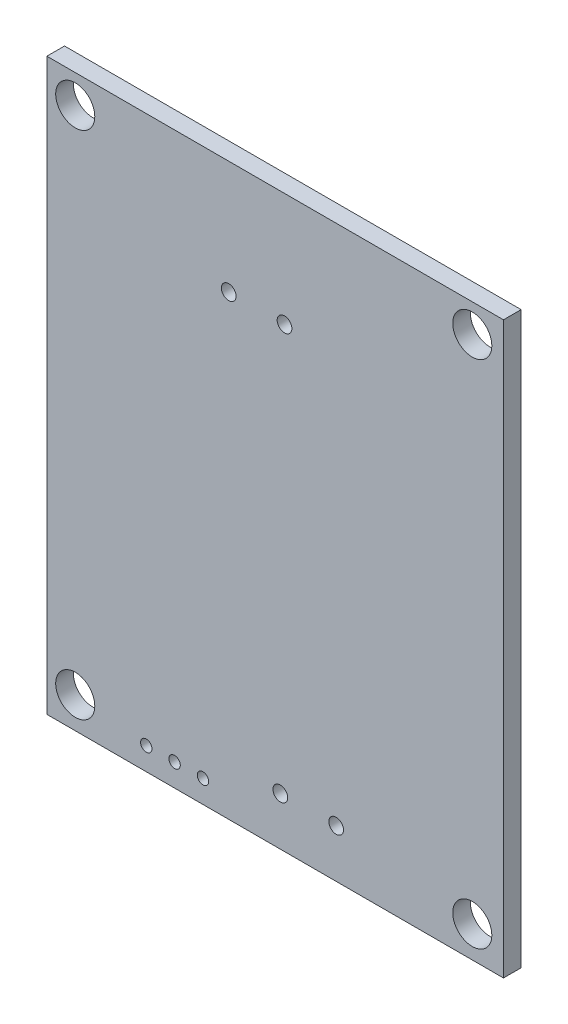
ISO-10303-21;
HEADER;
FILE_DESCRIPTION(('STEP AP214'),'2;1');
FILE_NAME('part.step','',(''),(''),'','','');
FILE_SCHEMA(('AUTOMOTIVE_DESIGN { 1 0 10303 214 1 1 1 1 }'));
ENDSEC;
DATA;
#1=APPLICATION_CONTEXT('core data for automotive mechanical design processes');
#2=APPLICATION_PROTOCOL_DEFINITION('international standard','automotive_design',2000,#1);
#3=PRODUCT_CONTEXT('',#1,'mechanical');
#4=PRODUCT('Part','Part','',(#3));
#5=PRODUCT_RELATED_PRODUCT_CATEGORY('part','',(#4));
#6=PRODUCT_DEFINITION_FORMATION('','',#4);
#7=PRODUCT_DEFINITION_CONTEXT('part definition',#1,'design');
#8=PRODUCT_DEFINITION('design','',#6,#7);
#9=PRODUCT_DEFINITION_SHAPE('','',#8);
#10=(LENGTH_UNIT() NAMED_UNIT(*) SI_UNIT(.MILLI.,.METRE.));
#11=(NAMED_UNIT(*) PLANE_ANGLE_UNIT() SI_UNIT($,.RADIAN.));
#12=(NAMED_UNIT(*) SI_UNIT($,.STERADIAN.) SOLID_ANGLE_UNIT());
#13=UNCERTAINTY_MEASURE_WITH_UNIT(LENGTH_MEASURE(1.E-05),#10,'distance_accuracy_value','');
#14=(GEOMETRIC_REPRESENTATION_CONTEXT(3) GLOBAL_UNCERTAINTY_ASSIGNED_CONTEXT((#13)) GLOBAL_UNIT_ASSIGNED_CONTEXT((#10,
#11,#12)) REPRESENTATION_CONTEXT('',''));
#15=CARTESIAN_POINT('',(0.,0.,0.));
#16=DIRECTION('',(0.,0.,1.));
#17=DIRECTION('',(1.,0.,0.));
#18=AXIS2_PLACEMENT_3D('',#15,#16,#17);
#19=CARTESIAN_POINT('',(148.59,-27.94,-0.79));
#20=DIRECTION('',(0.,0.,1.));
#21=DIRECTION('',(1.,0.,0.));
#22=AXIS2_PLACEMENT_3D('',#19,#20,#21);
#23=CYLINDRICAL_SURFACE('',#22,1.75);
#24=DIRECTION('',(0.,0.,1.));
#25=VECTOR('',#24,1.);
#26=CARTESIAN_POINT('',(150.34,-27.94,-0.79));
#27=LINE('',#26,#25);
#28=CARTESIAN_POINT('',(150.34,-27.94,0.));
#29=VERTEX_POINT('',#28);
#30=CARTESIAN_POINT('',(150.34,-27.94,1.58));
#31=VERTEX_POINT('',#30);
#32=EDGE_CURVE('E11',#29,#31,#27,.T.);
#33=ORIENTED_EDGE('',*,*,#32,.F.);
#34=CARTESIAN_POINT('',(148.59,-27.94,0.));
#35=DIRECTION('',(0.,0.,1.));
#36=DIRECTION('',(1.,0.,0.));
#37=AXIS2_PLACEMENT_3D('',#34,#35,#36);
#38=CIRCLE('',#37,1.75);
#39=EDGE_CURVE('E158',#29,#29,#38,.T.);
#40=ORIENTED_EDGE('',*,*,#39,.F.);
#41=ORIENTED_EDGE('',*,*,#32,.T.);
#42=CARTESIAN_POINT('',(148.59,-27.94,1.58));
#43=DIRECTION('',(0.,0.,1.));
#44=DIRECTION('',(1.,0.,0.));
#45=AXIS2_PLACEMENT_3D('',#42,#43,#44);
#46=CIRCLE('',#45,1.75);
#47=EDGE_CURVE('E266',#31,#31,#46,.T.);
#48=ORIENTED_EDGE('',*,*,#47,.T.);
#49=EDGE_LOOP('',(#33,#40,#41,#48));
#50=FACE_BOUND('',#49,.T.);
#51=ADVANCED_FACE('F16',(#50),#23,.F.);
#52=CARTESIAN_POINT('',(162.335,-35.56,-0.79));
#53=DIRECTION('',(0.,0.,1.));
#54=DIRECTION('',(1.,0.,0.));
#55=AXIS2_PLACEMENT_3D('',#52,#53,#54);
#56=CYLINDRICAL_SURFACE('',#55,0.66);
#57=DIRECTION('',(0.,0.,1.));
#58=VECTOR('',#57,1.);
#59=CARTESIAN_POINT('',(162.995,-35.56,-0.79));
#60=LINE('',#59,#58);
#61=CARTESIAN_POINT('',(162.995,-35.56,0.));
#62=VERTEX_POINT('',#61);
#63=CARTESIAN_POINT('',(162.995,-35.56,1.58));
#64=VERTEX_POINT('',#63);
#65=EDGE_CURVE('E27',#62,#64,#60,.T.);
#66=ORIENTED_EDGE('',*,*,#65,.F.);
#67=CARTESIAN_POINT('',(162.335,-35.56,0.));
#68=DIRECTION('',(0.,0.,1.));
#69=DIRECTION('',(1.,0.,0.));
#70=AXIS2_PLACEMENT_3D('',#67,#68,#69);
#71=CIRCLE('',#70,0.66);
#72=EDGE_CURVE('E218',#62,#62,#71,.T.);
#73=ORIENTED_EDGE('',*,*,#72,.F.);
#74=ORIENTED_EDGE('',*,*,#65,.T.);
#75=CARTESIAN_POINT('',(162.335,-35.56,1.58));
#76=DIRECTION('',(0.,0.,1.));
#77=DIRECTION('',(1.,0.,0.));
#78=AXIS2_PLACEMENT_3D('',#75,#76,#77);
#79=CIRCLE('',#78,0.66);
#80=EDGE_CURVE('E237',#64,#64,#79,.T.);
#81=ORIENTED_EDGE('',*,*,#80,.T.);
#82=EDGE_LOOP('',(#66,#73,#74,#81));
#83=FACE_BOUND('',#82,.T.);
#84=ADVANCED_FACE('F352',(#83),#56,.F.);
#85=CARTESIAN_POINT('',(167.335,-35.56,-0.79));
#86=DIRECTION('',(0.,0.,1.));
#87=DIRECTION('',(1.,0.,0.));
#88=AXIS2_PLACEMENT_3D('',#85,#86,#87);
#89=CYLINDRICAL_SURFACE('',#88,0.66);
#90=DIRECTION('',(0.,0.,1.));
#91=VECTOR('',#90,1.);
#92=CARTESIAN_POINT('',(167.995,-35.56,-0.79));
#93=LINE('',#92,#91);
#94=CARTESIAN_POINT('',(167.995,-35.56,0.));
#95=VERTEX_POINT('',#94);
#96=CARTESIAN_POINT('',(167.995,-35.56,1.58));
#97=VERTEX_POINT('',#96);
#98=EDGE_CURVE('E211',#95,#97,#93,.T.);
#99=ORIENTED_EDGE('',*,*,#98,.F.);
#100=CARTESIAN_POINT('',(167.335,-35.56,0.));
#101=DIRECTION('',(0.,0.,1.));
#102=DIRECTION('',(1.,0.,0.));
#103=AXIS2_PLACEMENT_3D('',#100,#101,#102);
#104=CIRCLE('',#103,0.66);
#105=EDGE_CURVE('E215',#95,#95,#104,.T.);
#106=ORIENTED_EDGE('',*,*,#105,.F.);
#107=ORIENTED_EDGE('',*,*,#98,.T.);
#108=CARTESIAN_POINT('',(167.335,-35.56,1.58));
#109=DIRECTION('',(0.,0.,1.));
#110=DIRECTION('',(1.,0.,0.));
#111=AXIS2_PLACEMENT_3D('',#108,#109,#110);
#112=CIRCLE('',#111,0.66);
#113=EDGE_CURVE('E233',#97,#97,#112,.T.);
#114=ORIENTED_EDGE('',*,*,#113,.T.);
#115=EDGE_LOOP('',(#99,#106,#107,#114));
#116=FACE_BOUND('',#115,.T.);
#117=ADVANCED_FACE('F357',(#116),#89,.F.);
#118=CARTESIAN_POINT('',(184.15,-27.94,-0.79));
#119=DIRECTION('',(0.,0.,1.));
#120=DIRECTION('',(1.,0.,0.));
#121=AXIS2_PLACEMENT_3D('',#118,#119,#120);
#122=CYLINDRICAL_SURFACE('',#121,1.75);
#123=DIRECTION('',(0.,0.,1.));
#124=VECTOR('',#123,1.);
#125=CARTESIAN_POINT('',(185.9,-27.94,-0.79));
#126=LINE('',#125,#124);
#127=CARTESIAN_POINT('',(185.9,-27.94,0.));
#128=VERTEX_POINT('',#127);
#129=CARTESIAN_POINT('',(185.9,-27.94,1.58));
#130=VERTEX_POINT('',#129);
#131=EDGE_CURVE('E214',#128,#130,#126,.T.);
#132=ORIENTED_EDGE('',*,*,#131,.F.);
#133=CARTESIAN_POINT('',(184.15,-27.94,0.));
#134=DIRECTION('',(0.,0.,1.));
#135=DIRECTION('',(1.,0.,0.));
#136=AXIS2_PLACEMENT_3D('',#133,#134,#135);
#137=CIRCLE('',#136,1.75);
#138=EDGE_CURVE('E219',#128,#128,#137,.T.);
#139=ORIENTED_EDGE('',*,*,#138,.F.);
#140=ORIENTED_EDGE('',*,*,#131,.T.);
#141=CARTESIAN_POINT('',(184.15,-27.94,1.58));
#142=DIRECTION('',(0.,0.,1.));
#143=DIRECTION('',(1.,0.,0.));
#144=AXIS2_PLACEMENT_3D('',#141,#142,#143);
#145=CIRCLE('',#144,1.75);
#146=EDGE_CURVE('E232',#130,#130,#145,.T.);
#147=ORIENTED_EDGE('',*,*,#146,.T.);
#148=EDGE_LOOP('',(#132,#139,#140,#147));
#149=FACE_BOUND('',#148,.T.);
#150=ADVANCED_FACE('F372',(#149),#122,.F.);
#151=CARTESIAN_POINT('',(148.59,-73.66,-0.79));
#152=DIRECTION('',(0.,0.,1.));
#153=DIRECTION('',(1.,0.,0.));
#154=AXIS2_PLACEMENT_3D('',#151,#152,#153);
#155=CYLINDRICAL_SURFACE('',#154,1.75);
#156=DIRECTION('',(0.,0.,1.));
#157=VECTOR('',#156,1.);
#158=CARTESIAN_POINT('',(150.34,-73.66,-0.79));
#159=LINE('',#158,#157);
#160=CARTESIAN_POINT('',(150.34,-73.66,0.));
#161=VERTEX_POINT('',#160);
#162=CARTESIAN_POINT('',(150.34,-73.66,1.58));
#163=VERTEX_POINT('',#162);
#164=EDGE_CURVE('E290',#161,#163,#159,.T.);
#165=ORIENTED_EDGE('',*,*,#164,.F.);
#166=CARTESIAN_POINT('',(148.59,-73.66,0.));
#167=DIRECTION('',(0.,0.,1.));
#168=DIRECTION('',(1.,0.,0.));
#169=AXIS2_PLACEMENT_3D('',#166,#167,#168);
#170=CIRCLE('',#169,1.75);
#171=EDGE_CURVE('E246',#161,#161,#170,.T.);
#172=ORIENTED_EDGE('',*,*,#171,.F.);
#173=ORIENTED_EDGE('',*,*,#164,.T.);
#174=CARTESIAN_POINT('',(148.59,-73.66,1.58));
#175=DIRECTION('',(0.,0.,1.));
#176=DIRECTION('',(1.,0.,0.));
#177=AXIS2_PLACEMENT_3D('',#174,#175,#176);
#178=CIRCLE('',#177,1.75);
#179=EDGE_CURVE('E228',#163,#163,#178,.T.);
#180=ORIENTED_EDGE('',*,*,#179,.T.);
#181=EDGE_LOOP('',(#165,#172,#173,#180));
#182=FACE_BOUND('',#181,.T.);
#183=ADVANCED_FACE('F18',(#182),#155,.F.);
#184=CARTESIAN_POINT('',(154.95,-74.422,-0.79));
#185=DIRECTION('',(0.,0.,1.));
#186=DIRECTION('',(1.,0.,0.));
#187=AXIS2_PLACEMENT_3D('',#184,#185,#186);
#188=CYLINDRICAL_SURFACE('',#187,0.51);
#189=DIRECTION('',(0.,0.,1.));
#190=VECTOR('',#189,1.);
#191=CARTESIAN_POINT('',(155.46,-74.422,-0.79));
#192=LINE('',#191,#190);
#193=CARTESIAN_POINT('',(155.46,-74.422,0.));
#194=VERTEX_POINT('',#193);
#195=CARTESIAN_POINT('',(155.46,-74.422,1.58));
#196=VERTEX_POINT('',#195);
#197=EDGE_CURVE('E188',#194,#196,#192,.T.);
#198=ORIENTED_EDGE('',*,*,#197,.F.);
#199=CARTESIAN_POINT('',(154.95,-74.422,0.));
#200=DIRECTION('',(0.,0.,1.));
#201=DIRECTION('',(1.,0.,0.));
#202=AXIS2_PLACEMENT_3D('',#199,#200,#201);
#203=CIRCLE('',#202,0.51);
#204=EDGE_CURVE('E224',#194,#194,#203,.T.);
#205=ORIENTED_EDGE('',*,*,#204,.F.);
#206=ORIENTED_EDGE('',*,*,#197,.T.);
#207=CARTESIAN_POINT('',(154.95,-74.422,1.58));
#208=DIRECTION('',(0.,0.,1.));
#209=DIRECTION('',(1.,0.,0.));
#210=AXIS2_PLACEMENT_3D('',#207,#208,#209);
#211=CIRCLE('',#210,0.51);
#212=EDGE_CURVE('E200',#196,#196,#211,.T.);
#213=ORIENTED_EDGE('',*,*,#212,.T.);
#214=EDGE_LOOP('',(#198,#205,#206,#213));
#215=FACE_BOUND('',#214,.T.);
#216=ADVANCED_FACE('F314',(#215),#188,.F.);
#217=CARTESIAN_POINT('',(157.49,-74.422,-0.79));
#218=DIRECTION('',(0.,0.,1.));
#219=DIRECTION('',(1.,0.,0.));
#220=AXIS2_PLACEMENT_3D('',#217,#218,#219);
#221=CYLINDRICAL_SURFACE('',#220,0.51);
#222=DIRECTION('',(0.,0.,1.));
#223=VECTOR('',#222,1.);
#224=CARTESIAN_POINT('',(158.,-74.422,-0.79));
#225=LINE('',#224,#223);
#226=CARTESIAN_POINT('',(158.,-74.422,0.));
#227=VERTEX_POINT('',#226);
#228=CARTESIAN_POINT('',(158.,-74.422,1.58));
#229=VERTEX_POINT('',#228);
#230=EDGE_CURVE('E185',#227,#229,#225,.T.);
#231=ORIENTED_EDGE('',*,*,#230,.F.);
#232=CARTESIAN_POINT('',(157.49,-74.422,0.));
#233=DIRECTION('',(0.,0.,1.));
#234=DIRECTION('',(1.,0.,0.));
#235=AXIS2_PLACEMENT_3D('',#232,#233,#234);
#236=CIRCLE('',#235,0.51);
#237=EDGE_CURVE('E206',#227,#227,#236,.T.);
#238=ORIENTED_EDGE('',*,*,#237,.F.);
#239=ORIENTED_EDGE('',*,*,#230,.T.);
#240=CARTESIAN_POINT('',(157.49,-74.422,1.58));
#241=DIRECTION('',(0.,0.,1.));
#242=DIRECTION('',(1.,0.,0.));
#243=AXIS2_PLACEMENT_3D('',#240,#241,#242);
#244=CIRCLE('',#243,0.51);
#245=EDGE_CURVE('E196',#229,#229,#244,.T.);
#246=ORIENTED_EDGE('',*,*,#245,.T.);
#247=EDGE_LOOP('',(#231,#238,#239,#246));
#248=FACE_BOUND('',#247,.T.);
#249=ADVANCED_FACE('F363',(#248),#221,.F.);
#250=CARTESIAN_POINT('',(160.03,-74.422,-0.79));
#251=DIRECTION('',(0.,0.,1.));
#252=DIRECTION('',(1.,0.,0.));
#253=AXIS2_PLACEMENT_3D('',#250,#251,#252);
#254=CYLINDRICAL_SURFACE('',#253,0.51);
#255=DIRECTION('',(0.,0.,1.));
#256=VECTOR('',#255,1.);
#257=CARTESIAN_POINT('',(160.54,-74.422,-0.79));
#258=LINE('',#257,#256);
#259=CARTESIAN_POINT('',(160.54,-74.422,0.));
#260=VERTEX_POINT('',#259);
#261=CARTESIAN_POINT('',(160.54,-74.422,1.58));
#262=VERTEX_POINT('',#261);
#263=EDGE_CURVE('E189',#260,#262,#258,.T.);
#264=ORIENTED_EDGE('',*,*,#263,.F.);
#265=CARTESIAN_POINT('',(160.03,-74.422,0.));
#266=DIRECTION('',(0.,0.,1.));
#267=DIRECTION('',(1.,0.,0.));
#268=AXIS2_PLACEMENT_3D('',#265,#266,#267);
#269=CIRCLE('',#268,0.51);
#270=EDGE_CURVE('E202',#260,#260,#269,.T.);
#271=ORIENTED_EDGE('',*,*,#270,.F.);
#272=ORIENTED_EDGE('',*,*,#263,.T.);
#273=CARTESIAN_POINT('',(160.03,-74.422,1.58));
#274=DIRECTION('',(0.,0.,1.));
#275=DIRECTION('',(1.,0.,0.));
#276=AXIS2_PLACEMENT_3D('',#273,#274,#275);
#277=CIRCLE('',#276,0.51);
#278=EDGE_CURVE('E201',#262,#262,#277,.T.);
#279=ORIENTED_EDGE('',*,*,#278,.T.);
#280=EDGE_LOOP('',(#264,#271,#272,#279));
#281=FACE_BOUND('',#280,.T.);
#282=ADVANCED_FACE('F365',(#281),#254,.F.);
#283=CARTESIAN_POINT('',(166.958,-72.136,-0.79));
#284=DIRECTION('',(0.,0.,1.));
#285=DIRECTION('',(1.,0.,0.));
#286=AXIS2_PLACEMENT_3D('',#283,#284,#285);
#287=CYLINDRICAL_SURFACE('',#286,0.66);
#288=DIRECTION('',(0.,0.,1.));
#289=VECTOR('',#288,1.);
#290=CARTESIAN_POINT('',(167.618,-72.136,-0.79));
#291=LINE('',#290,#289);
#292=CARTESIAN_POINT('',(167.618,-72.136,0.));
#293=VERTEX_POINT('',#292);
#294=CARTESIAN_POINT('',(167.618,-72.136,1.58));
#295=VERTEX_POINT('',#294);
#296=EDGE_CURVE('E273',#293,#295,#291,.T.);
#297=ORIENTED_EDGE('',*,*,#296,.F.);
#298=CARTESIAN_POINT('',(166.958,-72.136,0.));
#299=DIRECTION('',(0.,0.,1.));
#300=DIRECTION('',(1.,0.,0.));
#301=AXIS2_PLACEMENT_3D('',#298,#299,#300);
#302=CIRCLE('',#301,0.66);
#303=EDGE_CURVE('E20',#293,#293,#302,.T.);
#304=ORIENTED_EDGE('',*,*,#303,.F.);
#305=ORIENTED_EDGE('',*,*,#296,.T.);
#306=CARTESIAN_POINT('',(166.958,-72.136,1.58));
#307=DIRECTION('',(0.,0.,1.));
#308=DIRECTION('',(1.,0.,0.));
#309=AXIS2_PLACEMENT_3D('',#306,#307,#308);
#310=CIRCLE('',#309,0.66);
#311=EDGE_CURVE('E210',#295,#295,#310,.T.);
#312=ORIENTED_EDGE('',*,*,#311,.T.);
#313=EDGE_LOOP('',(#297,#304,#305,#312));
#314=FACE_BOUND('',#313,.T.);
#315=ADVANCED_FACE('F413',(#314),#287,.F.);
#316=CARTESIAN_POINT('',(171.958,-72.136,-0.79));
#317=DIRECTION('',(0.,0.,1.));
#318=DIRECTION('',(1.,0.,0.));
#319=AXIS2_PLACEMENT_3D('',#316,#317,#318);
#320=CYLINDRICAL_SURFACE('',#319,0.66);
#321=DIRECTION('',(0.,0.,1.));
#322=VECTOR('',#321,1.);
#323=CARTESIAN_POINT('',(172.618,-72.136,-0.79));
#324=LINE('',#323,#322);
#325=CARTESIAN_POINT('',(172.618,-72.136,0.));
#326=VERTEX_POINT('',#325);
#327=CARTESIAN_POINT('',(172.618,-72.136,1.58));
#328=VERTEX_POINT('',#327);
#329=EDGE_CURVE('E270',#326,#328,#324,.T.);
#330=ORIENTED_EDGE('',*,*,#329,.F.);
#331=CARTESIAN_POINT('',(171.958,-72.136,0.));
#332=DIRECTION('',(0.,0.,1.));
#333=DIRECTION('',(1.,0.,0.));
#334=AXIS2_PLACEMENT_3D('',#331,#332,#333);
#335=CIRCLE('',#334,0.66);
#336=EDGE_CURVE('E299',#326,#326,#335,.T.);
#337=ORIENTED_EDGE('',*,*,#336,.F.);
#338=ORIENTED_EDGE('',*,*,#329,.T.);
#339=CARTESIAN_POINT('',(171.958,-72.136,1.58));
#340=DIRECTION('',(0.,0.,1.));
#341=DIRECTION('',(1.,0.,0.));
#342=AXIS2_PLACEMENT_3D('',#339,#340,#341);
#343=CIRCLE('',#342,0.66);
#344=EDGE_CURVE('E241',#328,#328,#343,.T.);
#345=ORIENTED_EDGE('',*,*,#344,.T.);
#346=EDGE_LOOP('',(#330,#337,#338,#345));
#347=FACE_BOUND('',#346,.T.);
#348=ADVANCED_FACE('F408',(#347),#320,.F.);
#349=CARTESIAN_POINT('',(184.15,-73.66,-0.79));
#350=DIRECTION('',(0.,0.,1.));
#351=DIRECTION('',(1.,0.,0.));
#352=AXIS2_PLACEMENT_3D('',#349,#350,#351);
#353=CYLINDRICAL_SURFACE('',#352,1.75);
#354=DIRECTION('',(0.,0.,1.));
#355=VECTOR('',#354,1.);
#356=CARTESIAN_POINT('',(185.9,-73.66,-0.79));
#357=LINE('',#356,#355);
#358=CARTESIAN_POINT('',(185.9,-73.66,0.));
#359=VERTEX_POINT('',#358);
#360=CARTESIAN_POINT('',(185.9,-73.66,1.58));
#361=VERTEX_POINT('',#360);
#362=EDGE_CURVE('E269',#359,#361,#357,.T.);
#363=ORIENTED_EDGE('',*,*,#362,.F.);
#364=CARTESIAN_POINT('',(184.15,-73.66,0.));
#365=DIRECTION('',(0.,0.,1.));
#366=DIRECTION('',(1.,0.,0.));
#367=AXIS2_PLACEMENT_3D('',#364,#365,#366);
#368=CIRCLE('',#367,1.75);
#369=EDGE_CURVE('E227',#359,#359,#368,.T.);
#370=ORIENTED_EDGE('',*,*,#369,.F.);
#371=ORIENTED_EDGE('',*,*,#362,.T.);
#372=CARTESIAN_POINT('',(184.15,-73.66,1.58));
#373=DIRECTION('',(0.,0.,1.));
#374=DIRECTION('',(1.,0.,0.));
#375=AXIS2_PLACEMENT_3D('',#372,#373,#374);
#376=CIRCLE('',#375,1.75);
#377=EDGE_CURVE('E157',#361,#361,#376,.T.);
#378=ORIENTED_EDGE('',*,*,#377,.T.);
#379=EDGE_LOOP('',(#363,#370,#371,#378));
#380=FACE_BOUND('',#379,.T.);
#381=ADVANCED_FACE('F361',(#380),#353,.F.);
#382=CARTESIAN_POINT('',(146.05,-25.4,0.));
#383=DIRECTION('',(0.,1.,0.));
#384=DIRECTION('',(1.,0.,0.));
#385=AXIS2_PLACEMENT_3D('',#382,#383,#384);
#386=PLANE('',#385);
#387=DIRECTION('',(0.,0.,1.));
#388=VECTOR('',#387,1.);
#389=CARTESIAN_POINT('',(146.05,-25.4,0.));
#390=LINE('',#389,#388);
#391=CARTESIAN_POINT('',(146.05,-25.4,0.));
#392=VERTEX_POINT('',#391);
#393=CARTESIAN_POINT('',(146.05,-25.4,1.58));
#394=VERTEX_POINT('',#393);
#395=EDGE_CURVE('E153',#392,#394,#390,.T.);
#396=ORIENTED_EDGE('',*,*,#395,.T.);
#397=DIRECTION('',(1.,0.,0.));
#398=VECTOR('',#397,1.);
#399=CARTESIAN_POINT('',(146.05,-25.4,1.58));
#400=LINE('',#399,#398);
#401=CARTESIAN_POINT('',(186.944,-25.4,1.58));
#402=VERTEX_POINT('',#401);
#403=EDGE_CURVE('E147',#394,#402,#400,.T.);
#404=ORIENTED_EDGE('',*,*,#403,.T.);
#405=DIRECTION('',(0.,0.,1.));
#406=VECTOR('',#405,1.);
#407=CARTESIAN_POINT('',(186.944,-25.4,0.));
#408=LINE('',#407,#406);
#409=CARTESIAN_POINT('',(186.944,-25.4,0.));
#410=VERTEX_POINT('',#409);
#411=EDGE_CURVE('E151',#410,#402,#408,.T.);
#412=ORIENTED_EDGE('',*,*,#411,.F.);
#413=DIRECTION('',(1.,0.,0.));
#414=VECTOR('',#413,1.);
#415=CARTESIAN_POINT('',(146.05,-25.4,0.));
#416=LINE('',#415,#414);
#417=EDGE_CURVE('E139',#392,#410,#416,.T.);
#418=ORIENTED_EDGE('',*,*,#417,.F.);
#419=EDGE_LOOP('',(#396,#404,#412,#418));
#420=FACE_BOUND('',#419,.T.);
#421=ADVANCED_FACE('F149',(#420),#386,.T.);
#422=CARTESIAN_POINT('',(166.497,-50.927,1.58));
#423=DIRECTION('',(0.,0.,-1.));
#424=DIRECTION('',(0.,-1.,0.));
#425=AXIS2_PLACEMENT_3D('',#422,#423,#424);
#426=PLANE('',#425);
#427=ORIENTED_EDGE('',*,*,#47,.F.);
#428=EDGE_LOOP('',(#427));
#429=FACE_BOUND('',#428,.T.);
#430=ORIENTED_EDGE('',*,*,#80,.F.);
#431=EDGE_LOOP('',(#430));
#432=FACE_BOUND('',#431,.T.);
#433=ORIENTED_EDGE('',*,*,#113,.F.);
#434=EDGE_LOOP('',(#433));
#435=FACE_BOUND('',#434,.T.);
#436=ORIENTED_EDGE('',*,*,#146,.F.);
#437=EDGE_LOOP('',(#436));
#438=FACE_BOUND('',#437,.T.);
#439=ORIENTED_EDGE('',*,*,#179,.F.);
#440=EDGE_LOOP('',(#439));
#441=FACE_BOUND('',#440,.T.);
#442=ORIENTED_EDGE('',*,*,#212,.F.);
#443=EDGE_LOOP('',(#442));
#444=FACE_BOUND('',#443,.T.);
#445=ORIENTED_EDGE('',*,*,#245,.F.);
#446=EDGE_LOOP('',(#445));
#447=FACE_BOUND('',#446,.T.);
#448=ORIENTED_EDGE('',*,*,#278,.F.);
#449=EDGE_LOOP('',(#448));
#450=FACE_BOUND('',#449,.T.);
#451=ORIENTED_EDGE('',*,*,#311,.F.);
#452=EDGE_LOOP('',(#451));
#453=FACE_BOUND('',#452,.T.);
#454=ORIENTED_EDGE('',*,*,#344,.F.);
#455=EDGE_LOOP('',(#454));
#456=FACE_BOUND('',#455,.T.);
#457=ORIENTED_EDGE('',*,*,#377,.F.);
#458=EDGE_LOOP('',(#457));
#459=FACE_BOUND('',#458,.T.);
#460=DIRECTION('',(0.,-1.,0.));
#461=VECTOR('',#460,1.);
#462=CARTESIAN_POINT('',(186.944,-25.4,1.58));
#463=LINE('',#462,#461);
#464=CARTESIAN_POINT('',(186.944,-76.454,1.58));
#465=VERTEX_POINT('',#464);
#466=EDGE_CURVE('E162',#402,#465,#463,.T.);
#467=ORIENTED_EDGE('',*,*,#466,.F.);
#468=ORIENTED_EDGE('',*,*,#403,.F.);
#469=DIRECTION('',(0.,1.,0.));
#470=VECTOR('',#469,1.);
#471=CARTESIAN_POINT('',(146.05,-76.454,1.58));
#472=LINE('',#471,#470);
#473=CARTESIAN_POINT('',(146.05,-76.454,1.58));
#474=VERTEX_POINT('',#473);
#475=EDGE_CURVE('E195',#474,#394,#472,.T.);
#476=ORIENTED_EDGE('',*,*,#475,.F.);
#477=DIRECTION('',(-1.,0.,0.));
#478=VECTOR('',#477,1.);
#479=CARTESIAN_POINT('',(186.944,-76.454,1.58));
#480=LINE('',#479,#478);
#481=EDGE_CURVE('E165',#465,#474,#480,.T.);
#482=ORIENTED_EDGE('',*,*,#481,.F.);
#483=EDGE_LOOP('',(#467,#468,#476,#482));
#484=FACE_BOUND('',#483,.T.);
#485=ADVANCED_FACE('F163',(#429,#432,#435,#438,#441,#444,#447,#450,#453,#456,#459,#484),#426,.F.);
#486=CARTESIAN_POINT('',(166.497,-50.927,0.));
#487=DIRECTION('',(0.,0.,-1.));
#488=DIRECTION('',(0.,-1.,0.));
#489=AXIS2_PLACEMENT_3D('',#486,#487,#488);
#490=PLANE('',#489);
#491=ORIENTED_EDGE('',*,*,#39,.T.);
#492=EDGE_LOOP('',(#491));
#493=FACE_BOUND('',#492,.T.);
#494=ORIENTED_EDGE('',*,*,#72,.T.);
#495=EDGE_LOOP('',(#494));
#496=FACE_BOUND('',#495,.T.);
#497=ORIENTED_EDGE('',*,*,#105,.T.);
#498=EDGE_LOOP('',(#497));
#499=FACE_BOUND('',#498,.T.);
#500=ORIENTED_EDGE('',*,*,#138,.T.);
#501=EDGE_LOOP('',(#500));
#502=FACE_BOUND('',#501,.T.);
#503=ORIENTED_EDGE('',*,*,#171,.T.);
#504=EDGE_LOOP('',(#503));
#505=FACE_BOUND('',#504,.T.);
#506=ORIENTED_EDGE('',*,*,#204,.T.);
#507=EDGE_LOOP('',(#506));
#508=FACE_BOUND('',#507,.T.);
#509=ORIENTED_EDGE('',*,*,#237,.T.);
#510=EDGE_LOOP('',(#509));
#511=FACE_BOUND('',#510,.T.);
#512=ORIENTED_EDGE('',*,*,#270,.T.);
#513=EDGE_LOOP('',(#512));
#514=FACE_BOUND('',#513,.T.);
#515=ORIENTED_EDGE('',*,*,#303,.T.);
#516=EDGE_LOOP('',(#515));
#517=FACE_BOUND('',#516,.T.);
#518=ORIENTED_EDGE('',*,*,#336,.T.);
#519=EDGE_LOOP('',(#518));
#520=FACE_BOUND('',#519,.T.);
#521=ORIENTED_EDGE('',*,*,#369,.T.);
#522=EDGE_LOOP('',(#521));
#523=FACE_BOUND('',#522,.T.);
#524=DIRECTION('',(-1.,0.,0.));
#525=VECTOR('',#524,1.);
#526=CARTESIAN_POINT('',(186.944,-76.454,0.));
#527=LINE('',#526,#525);
#528=CARTESIAN_POINT('',(186.944,-76.454,0.));
#529=VERTEX_POINT('',#528);
#530=CARTESIAN_POINT('',(146.05,-76.454,0.));
#531=VERTEX_POINT('',#530);
#532=EDGE_CURVE('E174',#529,#531,#527,.T.);
#533=ORIENTED_EDGE('',*,*,#532,.T.);
#534=DIRECTION('',(0.,1.,0.));
#535=VECTOR('',#534,1.);
#536=CARTESIAN_POINT('',(146.05,-76.454,0.));
#537=LINE('',#536,#535);
#538=EDGE_CURVE('E183',#531,#392,#537,.T.);
#539=ORIENTED_EDGE('',*,*,#538,.T.);
#540=ORIENTED_EDGE('',*,*,#417,.T.);
#541=DIRECTION('',(0.,-1.,0.));
#542=VECTOR('',#541,1.);
#543=CARTESIAN_POINT('',(186.944,-25.4,0.));
#544=LINE('',#543,#542);
#545=EDGE_CURVE('E170',#410,#529,#544,.T.);
#546=ORIENTED_EDGE('',*,*,#545,.T.);
#547=EDGE_LOOP('',(#533,#539,#540,#546));
#548=FACE_BOUND('',#547,.T.);
#549=ADVANCED_FACE('F321',(#493,#496,#499,#502,#505,#508,#511,#514,#517,#520,#523,#548),#490,.T.);
#550=CARTESIAN_POINT('',(146.05,-76.454,0.));
#551=DIRECTION('',(-1.,0.,0.));
#552=DIRECTION('',(0.,0.,1.));
#553=AXIS2_PLACEMENT_3D('',#550,#551,#552);
#554=PLANE('',#553);
#555=DIRECTION('',(0.,0.,1.));
#556=VECTOR('',#555,1.);
#557=CARTESIAN_POINT('',(146.05,-76.454,0.));
#558=LINE('',#557,#556);
#559=EDGE_CURVE('E180',#531,#474,#558,.T.);
#560=ORIENTED_EDGE('',*,*,#559,.T.);
#561=ORIENTED_EDGE('',*,*,#475,.T.);
#562=ORIENTED_EDGE('',*,*,#395,.F.);
#563=ORIENTED_EDGE('',*,*,#538,.F.);
#564=EDGE_LOOP('',(#560,#561,#562,#563));
#565=FACE_BOUND('',#564,.T.);
#566=ADVANCED_FACE('F324',(#565),#554,.T.);
#567=CARTESIAN_POINT('',(186.944,-25.4,0.));
#568=DIRECTION('',(1.,0.,0.));
#569=DIRECTION('',(0.,1.,0.));
#570=AXIS2_PLACEMENT_3D('',#567,#568,#569);
#571=PLANE('',#570);
#572=ORIENTED_EDGE('',*,*,#411,.T.);
#573=ORIENTED_EDGE('',*,*,#466,.T.);
#574=DIRECTION('',(0.,0.,1.));
#575=VECTOR('',#574,1.);
#576=CARTESIAN_POINT('',(186.944,-76.454,0.));
#577=LINE('',#576,#575);
#578=EDGE_CURVE('E190',#529,#465,#577,.T.);
#579=ORIENTED_EDGE('',*,*,#578,.F.);
#580=ORIENTED_EDGE('',*,*,#545,.F.);
#581=EDGE_LOOP('',(#572,#573,#579,#580));
#582=FACE_BOUND('',#581,.T.);
#583=ADVANCED_FACE('F172',(#582),#571,.T.);
#584=CARTESIAN_POINT('',(186.944,-76.454,0.));
#585=DIRECTION('',(0.,-1.,0.));
#586=DIRECTION('',(0.,0.,-1.));
#587=AXIS2_PLACEMENT_3D('',#584,#585,#586);
#588=PLANE('',#587);
#589=ORIENTED_EDGE('',*,*,#578,.T.);
#590=ORIENTED_EDGE('',*,*,#481,.T.);
#591=ORIENTED_EDGE('',*,*,#559,.F.);
#592=ORIENTED_EDGE('',*,*,#532,.F.);
#593=EDGE_LOOP('',(#589,#590,#591,#592));
#594=FACE_BOUND('',#593,.T.);
#595=ADVANCED_FACE('F341',(#594),#588,.T.);
#596=CLOSED_SHELL('',(#51,#84,#117,#150,#183,#216,#249,#282,#315,#348,#381,#421,#485,#549,#566,
#583,#595));
#597=MANIFOLD_SOLID_BREP('B1',#596);
#598=ADVANCED_BREP_SHAPE_REPRESENTATION('',(#18,#597),#14);
#599=SHAPE_DEFINITION_REPRESENTATION(#9,#598);
ENDSEC;
END-ISO-10303-21;
